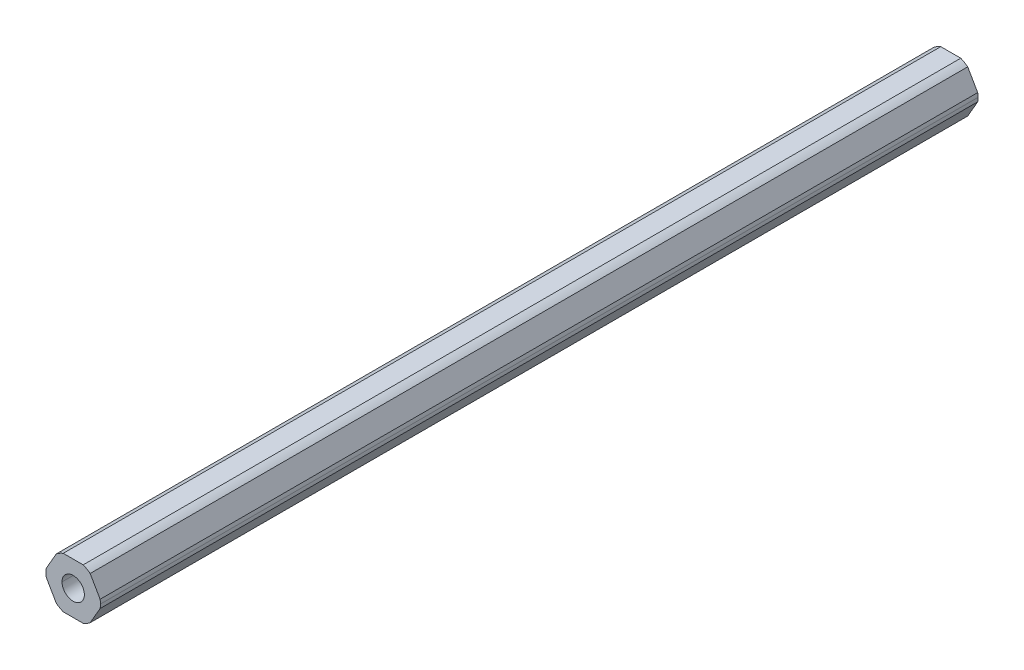
ISO-10303-21;
HEADER;
FILE_DESCRIPTION(('STEP AP214'),'2;1');
FILE_NAME('part.step','',(''),(''),'','','');
FILE_SCHEMA(('AUTOMOTIVE_DESIGN { 1 0 10303 214 1 1 1 1 }'));
ENDSEC;
DATA;
#1=APPLICATION_CONTEXT('core data for automotive mechanical design processes');
#2=APPLICATION_PROTOCOL_DEFINITION('international standard','automotive_design',2000,#1);
#3=PRODUCT_CONTEXT('',#1,'mechanical');
#4=PRODUCT('Part','Part','',(#3));
#5=PRODUCT_RELATED_PRODUCT_CATEGORY('part','',(#4));
#6=PRODUCT_DEFINITION_FORMATION('','',#4);
#7=PRODUCT_DEFINITION_CONTEXT('part definition',#1,'design');
#8=PRODUCT_DEFINITION('design','',#6,#7);
#9=PRODUCT_DEFINITION_SHAPE('','',#8);
#10=(LENGTH_UNIT() NAMED_UNIT(*) SI_UNIT(.MILLI.,.METRE.));
#11=(NAMED_UNIT(*) PLANE_ANGLE_UNIT() SI_UNIT($,.RADIAN.));
#12=(NAMED_UNIT(*) SI_UNIT($,.STERADIAN.) SOLID_ANGLE_UNIT());
#13=UNCERTAINTY_MEASURE_WITH_UNIT(LENGTH_MEASURE(1.E-05),#10,'distance_accuracy_value','');
#14=(GEOMETRIC_REPRESENTATION_CONTEXT(3) GLOBAL_UNCERTAINTY_ASSIGNED_CONTEXT((#13)) GLOBAL_UNIT_ASSIGNED_CONTEXT((#10,
#11,#12)) REPRESENTATION_CONTEXT('',''));
#15=CARTESIAN_POINT('',(0.,0.,0.));
#16=DIRECTION('',(0.,0.,1.));
#17=DIRECTION('',(1.,0.,0.));
#18=AXIS2_PLACEMENT_3D('',#15,#16,#17);
#19=CARTESIAN_POINT('',(0.,0.,-457.2));
#20=DIRECTION('',(0.,0.,1.));
#21=DIRECTION('',(1.,0.,0.));
#22=AXIS2_PLACEMENT_3D('',#19,#20,#21);
#23=CYLINDRICAL_SURFACE('',#22,2.1);
#24=CARTESIAN_POINT('',(0.,0.,-292.2));
#25=DIRECTION('',(0.,0.,1.));
#26=DIRECTION('',(1.,0.,0.));
#27=AXIS2_PLACEMENT_3D('',#24,#25,#26);
#28=CIRCLE('',#27,2.1);
#29=CARTESIAN_POINT('',(2.1,0.,-292.2));
#30=VERTEX_POINT('',#29);
#31=CARTESIAN_POINT('',(-2.1,0.,-292.2));
#32=VERTEX_POINT('',#31);
#33=EDGE_CURVE('E70',#30,#32,#28,.F.);
#34=ORIENTED_EDGE('',*,*,#33,.F.);
#35=DIRECTION('',(0.,0.,1.));
#36=VECTOR('',#35,1.);
#37=CARTESIAN_POINT('',(2.1,0.,-457.2));
#38=LINE('',#37,#36);
#39=CARTESIAN_POINT('',(2.1,0.,-457.2));
#40=VERTEX_POINT('',#39);
#41=EDGE_CURVE('E217',#40,#30,#38,.T.);
#42=ORIENTED_EDGE('',*,*,#41,.F.);
#43=CARTESIAN_POINT('',(0.,0.,-457.2));
#44=DIRECTION('',(0.,0.,1.));
#45=DIRECTION('',(1.,0.,0.));
#46=AXIS2_PLACEMENT_3D('',#43,#44,#45);
#47=CIRCLE('',#46,2.1);
#48=CARTESIAN_POINT('',(-2.1,0.,-457.2));
#49=VERTEX_POINT('',#48);
#50=EDGE_CURVE('E197',#49,#40,#47,.T.);
#51=ORIENTED_EDGE('',*,*,#50,.F.);
#52=DIRECTION('',(0.,0.,1.));
#53=VECTOR('',#52,1.);
#54=CARTESIAN_POINT('',(-2.1,0.,-457.2));
#55=LINE('',#54,#53);
#56=EDGE_CURVE('E57',#49,#32,#55,.T.);
#57=ORIENTED_EDGE('',*,*,#56,.T.);
#58=EDGE_LOOP('',(#34,#42,#51,#57));
#59=FACE_BOUND('',#58,.T.);
#60=ADVANCED_FACE('F48',(#59),#23,.F.);
#61=CARTESIAN_POINT('',(0.,0.,-457.2));
#62=DIRECTION('',(0.,0.,1.));
#63=DIRECTION('',(1.,0.,0.));
#64=AXIS2_PLACEMENT_3D('',#61,#62,#63);
#65=CYLINDRICAL_SURFACE('',#64,5.12);
#66=DIRECTION('',(0.,0.,1.));
#67=VECTOR('',#66,1.);
#68=CARTESIAN_POINT('',(5.12,0.,-457.2));
#69=LINE('',#68,#67);
#70=CARTESIAN_POINT('',(5.12,0.,-457.2));
#71=VERTEX_POINT('',#70);
#72=CARTESIAN_POINT('',(5.12,0.,-292.2));
#73=VERTEX_POINT('',#72);
#74=EDGE_CURVE('E232',#71,#73,#69,.T.);
#75=ORIENTED_EDGE('',*,*,#74,.T.);
#76=CARTESIAN_POINT('',(0.,0.,-292.2));
#77=DIRECTION('',(0.,0.,1.));
#78=DIRECTION('',(1.,0.,0.));
#79=AXIS2_PLACEMENT_3D('',#76,#77,#78);
#80=CIRCLE('',#79,5.12);
#81=CARTESIAN_POINT('',(5.06425896558911,-0.753446168913432,-292.2));
#82=VERTEX_POINT('',#81);
#83=EDGE_CURVE('E171',#82,#73,#80,.T.);
#84=ORIENTED_EDGE('',*,*,#83,.F.);
#85=DIRECTION('',(0.,0.,-1.));
#86=VECTOR('',#85,1.);
#87=CARTESIAN_POINT('',(5.06425896558911,-0.753446168913433,-457.2));
#88=LINE('',#87,#86);
#89=CARTESIAN_POINT('',(5.06425896558911,-0.753446168913433,-457.2));
#90=VERTEX_POINT('',#89);
#91=EDGE_CURVE('E236',#82,#90,#88,.T.);
#92=ORIENTED_EDGE('',*,*,#91,.T.);
#93=CARTESIAN_POINT('',(0.,0.,-457.2));
#94=DIRECTION('',(0.,0.,1.));
#95=DIRECTION('',(1.,0.,0.));
#96=AXIS2_PLACEMENT_3D('',#93,#94,#95);
#97=CIRCLE('',#96,5.12);
#98=EDGE_CURVE('E235',#90,#71,#97,.T.);
#99=ORIENTED_EDGE('',*,*,#98,.T.);
#100=EDGE_LOOP('',(#75,#84,#92,#99));
#101=FACE_BOUND('',#100,.T.);
#102=ADVANCED_FACE('F417',(#101),#65,.T.);
#103=CARTESIAN_POINT('',(2.74963065701564,-4.7625,457.2));
#104=DIRECTION('',(-0.866025403784442,0.5,0.));
#105=DIRECTION('',(0.,0.,1.));
#106=AXIS2_PLACEMENT_3D('',#103,#104,#105);
#107=PLANE('',#106);
#108=DIRECTION('',(0.499999999999988,0.866025403784446,0.));
#109=VECTOR('',#108,1.);
#110=CARTESIAN_POINT('',(3.18463300545771,-4.00905383108655,-292.2));
#111=LINE('',#110,#109);
#112=CARTESIAN_POINT('',(3.18463300545771,-4.00905383108655,-292.2));
#113=VERTEX_POINT('',#112);
#114=EDGE_CURVE('E323',#113,#82,#111,.T.);
#115=ORIENTED_EDGE('',*,*,#114,.F.);
#116=DIRECTION('',(0.,0.,1.));
#117=VECTOR('',#116,1.);
#118=CARTESIAN_POINT('',(3.1846330054577,-4.00905383108652,-457.2));
#119=LINE('',#118,#117);
#120=CARTESIAN_POINT('',(3.1846330054577,-4.00905383108652,-457.2));
#121=VERTEX_POINT('',#120);
#122=EDGE_CURVE('E192',#121,#113,#119,.T.);
#123=ORIENTED_EDGE('',*,*,#122,.F.);
#124=DIRECTION('',(0.5,0.866025403784442,0.));
#125=VECTOR('',#124,1.);
#126=CARTESIAN_POINT('',(2.74963065701564,-4.7625,-457.2));
#127=LINE('',#126,#125);
#128=EDGE_CURVE('E246',#121,#90,#127,.T.);
#129=ORIENTED_EDGE('',*,*,#128,.T.);
#130=ORIENTED_EDGE('',*,*,#91,.F.);
#131=EDGE_LOOP('',(#115,#123,#129,#130));
#132=FACE_BOUND('',#131,.T.);
#133=ADVANCED_FACE('F426',(#132),#107,.F.);
#134=CARTESIAN_POINT('',(5.49926131403117,0.,457.2));
#135=DIRECTION('',(-0.866025403784438,-0.5,0.));
#136=DIRECTION('',(-0.5,0.866025403784438,0.));
#137=AXIS2_PLACEMENT_3D('',#134,#135,#136);
#138=PLANE('',#137);
#139=DIRECTION('',(-0.500000000000001,0.866025403784438,0.));
#140=VECTOR('',#139,1.);
#141=CARTESIAN_POINT('',(5.06425896558911,0.753446168913416,-292.2));
#142=LINE('',#141,#140);
#143=CARTESIAN_POINT('',(5.06425896558911,0.753446168913416,-292.2));
#144=VERTEX_POINT('',#143);
#145=CARTESIAN_POINT('',(3.18463300545762,4.00905383108658,-292.2));
#146=VERTEX_POINT('',#145);
#147=EDGE_CURVE('E64',#144,#146,#142,.T.);
#148=ORIENTED_EDGE('',*,*,#147,.F.);
#149=DIRECTION('',(0.,0.,1.));
#150=VECTOR('',#149,1.);
#151=CARTESIAN_POINT('',(5.06425896558911,0.753446168913412,-457.2));
#152=LINE('',#151,#150);
#153=CARTESIAN_POINT('',(5.06425896558911,0.753446168913416,-457.2));
#154=VERTEX_POINT('',#153);
#155=EDGE_CURVE('E181',#154,#144,#152,.T.);
#156=ORIENTED_EDGE('',*,*,#155,.F.);
#157=DIRECTION('',(-0.5,0.866025403784438,0.));
#158=VECTOR('',#157,1.);
#159=CARTESIAN_POINT('',(5.49926131403117,0.,-457.2));
#160=LINE('',#159,#158);
#161=CARTESIAN_POINT('',(3.18463300545762,4.00905383108658,-457.2));
#162=VERTEX_POINT('',#161);
#163=EDGE_CURVE('E225',#154,#162,#160,.T.);
#164=ORIENTED_EDGE('',*,*,#163,.T.);
#165=DIRECTION('',(0.,0.,-1.));
#166=VECTOR('',#165,1.);
#167=CARTESIAN_POINT('',(3.18463300545762,4.00905383108658,-457.2));
#168=LINE('',#167,#166);
#169=EDGE_CURVE('E183',#146,#162,#168,.T.);
#170=ORIENTED_EDGE('',*,*,#169,.F.);
#171=EDGE_LOOP('',(#148,#156,#164,#170));
#172=FACE_BOUND('',#171,.T.);
#173=ADVANCED_FACE('F179',(#172),#138,.F.);
#174=CARTESIAN_POINT('',(2.74963065701557,4.7625,457.2));
#175=DIRECTION('',(0.,-1.,0.));
#176=DIRECTION('',(0.,0.,-1.));
#177=AXIS2_PLACEMENT_3D('',#174,#175,#176);
#178=PLANE('',#177);
#179=DIRECTION('',(-1.,0.,0.));
#180=VECTOR('',#179,1.);
#181=CARTESIAN_POINT('',(1.87962596013146,4.76249999999999,-292.2));
#182=LINE('',#181,#180);
#183=CARTESIAN_POINT('',(1.87962596013146,4.76249999999999,-292.2));
#184=VERTEX_POINT('',#183);
#185=CARTESIAN_POINT('',(-1.8796259601315,4.7625,-292.2));
#186=VERTEX_POINT('',#185);
#187=EDGE_CURVE('E346',#184,#186,#182,.T.);
#188=ORIENTED_EDGE('',*,*,#187,.F.);
#189=DIRECTION('',(0.,0.,1.));
#190=VECTOR('',#189,1.);
#191=CARTESIAN_POINT('',(1.87962596013147,4.7625,-457.2));
#192=LINE('',#191,#190);
#193=CARTESIAN_POINT('',(1.87962596013147,4.7625,-457.2));
#194=VERTEX_POINT('',#193);
#195=EDGE_CURVE('E208',#194,#184,#192,.T.);
#196=ORIENTED_EDGE('',*,*,#195,.F.);
#197=DIRECTION('',(-1.,0.,0.));
#198=VECTOR('',#197,1.);
#199=CARTESIAN_POINT('',(2.74963065701557,4.7625,-457.2));
#200=LINE('',#199,#198);
#201=CARTESIAN_POINT('',(-1.8796259601315,4.7625,-457.2));
#202=VERTEX_POINT('',#201);
#203=EDGE_CURVE('E263',#194,#202,#200,.T.);
#204=ORIENTED_EDGE('',*,*,#203,.T.);
#205=DIRECTION('',(0.,0.,-1.));
#206=VECTOR('',#205,1.);
#207=CARTESIAN_POINT('',(-1.8796259601315,4.7625,-457.2));
#208=LINE('',#207,#206);
#209=EDGE_CURVE('E255',#186,#202,#208,.T.);
#210=ORIENTED_EDGE('',*,*,#209,.F.);
#211=EDGE_LOOP('',(#188,#196,#204,#210));
#212=FACE_BOUND('',#211,.T.);
#213=ADVANCED_FACE('F443',(#212),#178,.F.);
#214=CARTESIAN_POINT('',(-2.7496306570156,4.7625,457.2));
#215=DIRECTION('',(0.866025403784442,-0.5,0.));
#216=DIRECTION('',(0.,0.,-1.));
#217=AXIS2_PLACEMENT_3D('',#214,#215,#216);
#218=PLANE('',#217);
#219=DIRECTION('',(-0.499999999999991,-0.866025403784444,0.));
#220=VECTOR('',#219,1.);
#221=CARTESIAN_POINT('',(-3.18463300545767,4.00905383108657,-292.2));
#222=LINE('',#221,#220);
#223=CARTESIAN_POINT('',(-3.18463300545767,4.00905383108657,-292.2));
#224=VERTEX_POINT('',#223);
#225=CARTESIAN_POINT('',(-5.06425896558912,0.753446168913382,-292.2));
#226=VERTEX_POINT('',#225);
#227=EDGE_CURVE('E340',#224,#226,#222,.T.);
#228=ORIENTED_EDGE('',*,*,#227,.F.);
#229=DIRECTION('',(0.,0.,1.));
#230=VECTOR('',#229,1.);
#231=CARTESIAN_POINT('',(-3.18463300545766,4.00905383108655,-457.2));
#232=LINE('',#231,#230);
#233=CARTESIAN_POINT('',(-3.18463300545766,4.00905383108655,-457.2));
#234=VERTEX_POINT('',#233);
#235=EDGE_CURVE('E215',#234,#224,#232,.T.);
#236=ORIENTED_EDGE('',*,*,#235,.F.);
#237=DIRECTION('',(-0.5,-0.866025403784442,0.));
#238=VECTOR('',#237,1.);
#239=CARTESIAN_POINT('',(-2.7496306570156,4.7625,-457.2));
#240=LINE('',#239,#238);
#241=CARTESIAN_POINT('',(-5.06425896558912,0.753446168913382,-457.2));
#242=VERTEX_POINT('',#241);
#243=EDGE_CURVE('E260',#234,#242,#240,.T.);
#244=ORIENTED_EDGE('',*,*,#243,.T.);
#245=DIRECTION('',(0.,0.,-1.));
#246=VECTOR('',#245,1.);
#247=CARTESIAN_POINT('',(-5.06425896558912,0.753446168913382,-457.2));
#248=LINE('',#247,#246);
#249=EDGE_CURVE('E245',#226,#242,#248,.T.);
#250=ORIENTED_EDGE('',*,*,#249,.F.);
#251=EDGE_LOOP('',(#228,#236,#244,#250));
#252=FACE_BOUND('',#251,.T.);
#253=ADVANCED_FACE('F276',(#252),#218,.F.);
#254=CARTESIAN_POINT('',(-5.49926131403117,0.,457.2));
#255=DIRECTION('',(0.866025403784435,0.500000000000007,0.));
#256=DIRECTION('',(0.,0.,-1.));
#257=AXIS2_PLACEMENT_3D('',#254,#255,#256);
#258=PLANE('',#257);
#259=DIRECTION('',(0.500000000000006,-0.866025403784435,0.));
#260=VECTOR('',#259,1.);
#261=CARTESIAN_POINT('',(-5.06425896558911,-0.753446168913444,-292.2));
#262=LINE('',#261,#260);
#263=CARTESIAN_POINT('',(-5.06425896558911,-0.753446168913444,-292.2));
#264=VERTEX_POINT('',#263);
#265=CARTESIAN_POINT('',(-3.1846330054576,-4.00905383108659,-292.2));
#266=VERTEX_POINT('',#265);
#267=EDGE_CURVE('E335',#264,#266,#262,.T.);
#268=ORIENTED_EDGE('',*,*,#267,.F.);
#269=DIRECTION('',(0.,0.,1.));
#270=VECTOR('',#269,1.);
#271=CARTESIAN_POINT('',(-5.06425896558911,-0.75344616891345,-457.2));
#272=LINE('',#271,#270);
#273=CARTESIAN_POINT('',(-5.06425896558911,-0.75344616891345,-457.2));
#274=VERTEX_POINT('',#273);
#275=EDGE_CURVE('E253',#274,#264,#272,.T.);
#276=ORIENTED_EDGE('',*,*,#275,.F.);
#277=DIRECTION('',(0.500000000000007,-0.866025403784435,0.));
#278=VECTOR('',#277,1.);
#279=CARTESIAN_POINT('',(-5.49926131403117,0.,-457.2));
#280=LINE('',#279,#278);
#281=CARTESIAN_POINT('',(-3.1846330054576,-4.0090538310866,-457.2));
#282=VERTEX_POINT('',#281);
#283=EDGE_CURVE('E264',#274,#282,#280,.T.);
#284=ORIENTED_EDGE('',*,*,#283,.T.);
#285=DIRECTION('',(0.,0.,-1.));
#286=VECTOR('',#285,1.);
#287=CARTESIAN_POINT('',(-3.1846330054576,-4.0090538310866,-457.2));
#288=LINE('',#287,#286);
#289=EDGE_CURVE('E227',#266,#282,#288,.T.);
#290=ORIENTED_EDGE('',*,*,#289,.F.);
#291=EDGE_LOOP('',(#268,#276,#284,#290));
#292=FACE_BOUND('',#291,.T.);
#293=ADVANCED_FACE('F459',(#292),#258,.F.);
#294=CARTESIAN_POINT('',(-2.74963065701554,-4.7625,457.2));
#295=DIRECTION('',(0.,1.,0.));
#296=DIRECTION('',(1.,0.,0.));
#297=AXIS2_PLACEMENT_3D('',#294,#295,#296);
#298=PLANE('',#297);
#299=DIRECTION('',(1.,0.,0.));
#300=VECTOR('',#299,1.);
#301=CARTESIAN_POINT('',(-1.87962596013144,-4.7625,-292.2));
#302=LINE('',#301,#300);
#303=CARTESIAN_POINT('',(-1.87962596013144,-4.7625,-292.2));
#304=VERTEX_POINT('',#303);
#305=CARTESIAN_POINT('',(1.87962596013153,-4.7625,-292.2));
#306=VERTEX_POINT('',#305);
#307=EDGE_CURVE('E329',#304,#306,#302,.T.);
#308=ORIENTED_EDGE('',*,*,#307,.F.);
#309=DIRECTION('',(0.,0.,1.));
#310=VECTOR('',#309,1.);
#311=CARTESIAN_POINT('',(-1.87962596013144,-4.7625,-457.2));
#312=LINE('',#311,#310);
#313=CARTESIAN_POINT('',(-1.87962596013144,-4.7625,-457.2));
#314=VERTEX_POINT('',#313);
#315=EDGE_CURVE('E241',#314,#304,#312,.T.);
#316=ORIENTED_EDGE('',*,*,#315,.F.);
#317=DIRECTION('',(1.,0.,0.));
#318=VECTOR('',#317,1.);
#319=CARTESIAN_POINT('',(-2.74963065701554,-4.7625,-457.2));
#320=LINE('',#319,#318);
#321=CARTESIAN_POINT('',(1.87962596013154,-4.7625,-457.2));
#322=VERTEX_POINT('',#321);
#323=EDGE_CURVE('E289',#314,#322,#320,.T.);
#324=ORIENTED_EDGE('',*,*,#323,.T.);
#325=DIRECTION('',(0.,0.,-1.));
#326=VECTOR('',#325,1.);
#327=CARTESIAN_POINT('',(1.87962596013154,-4.7625,-457.2));
#328=LINE('',#327,#326);
#329=EDGE_CURVE('E200',#306,#322,#328,.T.);
#330=ORIENTED_EDGE('',*,*,#329,.F.);
#331=EDGE_LOOP('',(#308,#316,#324,#330));
#332=FACE_BOUND('',#331,.T.);
#333=ADVANCED_FACE('F467',(#332),#298,.F.);
#334=CARTESIAN_POINT('',(0.,0.,-457.2));
#335=DIRECTION('',(0.,0.,1.));
#336=DIRECTION('',(1.,0.,0.));
#337=AXIS2_PLACEMENT_3D('',#334,#335,#336);
#338=CYLINDRICAL_SURFACE('',#337,5.12);
#339=ORIENTED_EDGE('',*,*,#155,.T.);
#340=EDGE_CURVE('E168',#73,#144,#80,.T.);
#341=ORIENTED_EDGE('',*,*,#340,.F.);
#342=ORIENTED_EDGE('',*,*,#74,.F.);
#343=CARTESIAN_POINT('',(0.,0.,-457.2));
#344=DIRECTION('',(0.,0.,1.));
#345=DIRECTION('',(1.,0.,0.));
#346=AXIS2_PLACEMENT_3D('',#343,#344,#345);
#347=CIRCLE('',#346,5.12);
#348=EDGE_CURVE('E190',#71,#154,#347,.T.);
#349=ORIENTED_EDGE('',*,*,#348,.T.);
#350=EDGE_LOOP('',(#339,#341,#342,#349));
#351=FACE_BOUND('',#350,.T.);
#352=ADVANCED_FACE('F188',(#351),#338,.T.);
#353=CARTESIAN_POINT('',(0.,0.,-457.2));
#354=DIRECTION('',(0.,0.,1.));
#355=DIRECTION('',(1.,0.,0.));
#356=AXIS2_PLACEMENT_3D('',#353,#354,#355);
#357=CYLINDRICAL_SURFACE('',#356,5.12);
#358=ORIENTED_EDGE('',*,*,#122,.T.);
#359=CARTESIAN_POINT('',(0.,0.,-292.2));
#360=DIRECTION('',(0.,0.,1.));
#361=DIRECTION('',(1.,0.,0.));
#362=AXIS2_PLACEMENT_3D('',#359,#360,#361);
#363=CIRCLE('',#362,5.12000000000004);
#364=EDGE_CURVE('E326',#306,#113,#363,.T.);
#365=ORIENTED_EDGE('',*,*,#364,.F.);
#366=ORIENTED_EDGE('',*,*,#329,.T.);
#367=CARTESIAN_POINT('',(0.,0.,-457.2));
#368=DIRECTION('',(0.,0.,1.));
#369=DIRECTION('',(1.,0.,0.));
#370=AXIS2_PLACEMENT_3D('',#367,#368,#369);
#371=CIRCLE('',#370,5.12);
#372=EDGE_CURVE('E230',#322,#121,#371,.T.);
#373=ORIENTED_EDGE('',*,*,#372,.T.);
#374=EDGE_LOOP('',(#358,#365,#366,#373));
#375=FACE_BOUND('',#374,.T.);
#376=ADVANCED_FACE('F483',(#375),#357,.T.);
#377=CARTESIAN_POINT('',(0.,0.,-457.2));
#378=DIRECTION('',(0.,0.,1.));
#379=DIRECTION('',(1.,0.,0.));
#380=AXIS2_PLACEMENT_3D('',#377,#378,#379);
#381=CYLINDRICAL_SURFACE('',#380,5.12);
#382=ORIENTED_EDGE('',*,*,#315,.T.);
#383=CARTESIAN_POINT('',(0.,0.,-292.2));
#384=DIRECTION('',(0.,0.,1.));
#385=DIRECTION('',(1.,0.,0.));
#386=AXIS2_PLACEMENT_3D('',#383,#384,#385);
#387=CIRCLE('',#386,5.12);
#388=EDGE_CURVE('E332',#266,#304,#387,.T.);
#389=ORIENTED_EDGE('',*,*,#388,.F.);
#390=ORIENTED_EDGE('',*,*,#289,.T.);
#391=CARTESIAN_POINT('',(0.,0.,-457.2));
#392=DIRECTION('',(0.,0.,1.));
#393=DIRECTION('',(1.,0.,0.));
#394=AXIS2_PLACEMENT_3D('',#391,#392,#393);
#395=CIRCLE('',#394,5.12);
#396=EDGE_CURVE('E231',#282,#314,#395,.T.);
#397=ORIENTED_EDGE('',*,*,#396,.T.);
#398=EDGE_LOOP('',(#382,#389,#390,#397));
#399=FACE_BOUND('',#398,.T.);
#400=ADVANCED_FACE('F491',(#399),#381,.T.);
#401=CARTESIAN_POINT('',(0.,0.,-457.2));
#402=DIRECTION('',(0.,0.,1.));
#403=DIRECTION('',(1.,0.,0.));
#404=AXIS2_PLACEMENT_3D('',#401,#402,#403);
#405=CYLINDRICAL_SURFACE('',#404,5.12);
#406=ORIENTED_EDGE('',*,*,#275,.T.);
#407=CARTESIAN_POINT('',(0.,0.,-292.2));
#408=DIRECTION('',(0.,0.,1.));
#409=DIRECTION('',(1.,0.,0.));
#410=AXIS2_PLACEMENT_3D('',#407,#408,#409);
#411=CIRCLE('',#410,5.12);
#412=EDGE_CURVE('E272',#226,#264,#411,.T.);
#413=ORIENTED_EDGE('',*,*,#412,.F.);
#414=ORIENTED_EDGE('',*,*,#249,.T.);
#415=CARTESIAN_POINT('',(0.,0.,-457.2));
#416=DIRECTION('',(0.,0.,1.));
#417=DIRECTION('',(1.,0.,0.));
#418=AXIS2_PLACEMENT_3D('',#415,#416,#417);
#419=CIRCLE('',#418,5.12);
#420=EDGE_CURVE('E250',#242,#274,#419,.T.);
#421=ORIENTED_EDGE('',*,*,#420,.T.);
#422=EDGE_LOOP('',(#406,#413,#414,#421));
#423=FACE_BOUND('',#422,.T.);
#424=ADVANCED_FACE('F270',(#423),#405,.T.);
#425=CARTESIAN_POINT('',(0.,0.,-457.2));
#426=DIRECTION('',(0.,0.,1.));
#427=DIRECTION('',(1.,0.,0.));
#428=AXIS2_PLACEMENT_3D('',#425,#426,#427);
#429=CYLINDRICAL_SURFACE('',#428,5.12);
#430=ORIENTED_EDGE('',*,*,#235,.T.);
#431=CARTESIAN_POINT('',(0.,0.,-292.2));
#432=DIRECTION('',(0.,0.,1.));
#433=DIRECTION('',(1.,0.,0.));
#434=AXIS2_PLACEMENT_3D('',#431,#432,#433);
#435=CIRCLE('',#434,5.12000000000002);
#436=EDGE_CURVE('E343',#186,#224,#435,.T.);
#437=ORIENTED_EDGE('',*,*,#436,.F.);
#438=ORIENTED_EDGE('',*,*,#209,.T.);
#439=CARTESIAN_POINT('',(0.,0.,-457.2));
#440=DIRECTION('',(0.,0.,1.));
#441=DIRECTION('',(1.,0.,0.));
#442=AXIS2_PLACEMENT_3D('',#439,#440,#441);
#443=CIRCLE('',#442,5.12);
#444=EDGE_CURVE('E240',#202,#234,#443,.T.);
#445=ORIENTED_EDGE('',*,*,#444,.T.);
#446=EDGE_LOOP('',(#430,#437,#438,#445));
#447=FACE_BOUND('',#446,.T.);
#448=ADVANCED_FACE('F507',(#447),#429,.T.);
#449=CARTESIAN_POINT('',(0.,0.,-457.2));
#450=DIRECTION('',(0.,0.,1.));
#451=DIRECTION('',(1.,0.,0.));
#452=AXIS2_PLACEMENT_3D('',#449,#450,#451);
#453=CYLINDRICAL_SURFACE('',#452,5.12);
#454=ORIENTED_EDGE('',*,*,#195,.T.);
#455=CARTESIAN_POINT('',(0.,0.,-292.2));
#456=DIRECTION('',(0.,0.,1.));
#457=DIRECTION('',(1.,0.,0.));
#458=AXIS2_PLACEMENT_3D('',#455,#456,#457);
#459=CIRCLE('',#458,5.12);
#460=EDGE_CURVE('E185',#146,#184,#459,.T.);
#461=ORIENTED_EDGE('',*,*,#460,.F.);
#462=ORIENTED_EDGE('',*,*,#169,.T.);
#463=CARTESIAN_POINT('',(0.,0.,-457.2));
#464=DIRECTION('',(0.,0.,1.));
#465=DIRECTION('',(1.,0.,0.));
#466=AXIS2_PLACEMENT_3D('',#463,#464,#465);
#467=CIRCLE('',#466,5.12);
#468=EDGE_CURVE('E205',#162,#194,#467,.T.);
#469=ORIENTED_EDGE('',*,*,#468,.T.);
#470=EDGE_LOOP('',(#454,#461,#462,#469));
#471=FACE_BOUND('',#470,.T.);
#472=ADVANCED_FACE('F515',(#471),#453,.T.);
#473=CARTESIAN_POINT('',(0.,0.,-457.2));
#474=DIRECTION('',(0.,0.,1.));
#475=DIRECTION('',(1.,0.,0.));
#476=AXIS2_PLACEMENT_3D('',#473,#474,#475);
#477=CYLINDRICAL_SURFACE('',#476,2.1);
#478=CARTESIAN_POINT('',(0.,0.,-292.2));
#479=DIRECTION('',(0.,0.,1.));
#480=DIRECTION('',(1.,0.,0.));
#481=AXIS2_PLACEMENT_3D('',#478,#479,#480);
#482=CIRCLE('',#481,2.1);
#483=EDGE_CURVE('E11',#32,#30,#482,.F.);
#484=ORIENTED_EDGE('',*,*,#483,.F.);
#485=ORIENTED_EDGE('',*,*,#56,.F.);
#486=CARTESIAN_POINT('',(0.,0.,-457.2));
#487=DIRECTION('',(0.,0.,1.));
#488=DIRECTION('',(1.,0.,0.));
#489=AXIS2_PLACEMENT_3D('',#486,#487,#488);
#490=CIRCLE('',#489,2.1);
#491=EDGE_CURVE('E203',#40,#49,#490,.T.);
#492=ORIENTED_EDGE('',*,*,#491,.F.);
#493=ORIENTED_EDGE('',*,*,#41,.T.);
#494=EDGE_LOOP('',(#484,#485,#492,#493));
#495=FACE_BOUND('',#494,.T.);
#496=ADVANCED_FACE('F392',(#495),#477,.F.);
#497=CARTESIAN_POINT('',(0.,0.,-457.2));
#498=DIRECTION('',(0.,0.,1.));
#499=DIRECTION('',(1.,0.,0.));
#500=AXIS2_PLACEMENT_3D('',#497,#498,#499);
#501=PLANE('',#500);
#502=ORIENTED_EDGE('',*,*,#468,.F.);
#503=ORIENTED_EDGE('',*,*,#163,.F.);
#504=ORIENTED_EDGE('',*,*,#348,.F.);
#505=ORIENTED_EDGE('',*,*,#98,.F.);
#506=ORIENTED_EDGE('',*,*,#128,.F.);
#507=ORIENTED_EDGE('',*,*,#372,.F.);
#508=ORIENTED_EDGE('',*,*,#323,.F.);
#509=ORIENTED_EDGE('',*,*,#396,.F.);
#510=ORIENTED_EDGE('',*,*,#283,.F.);
#511=ORIENTED_EDGE('',*,*,#420,.F.);
#512=ORIENTED_EDGE('',*,*,#243,.F.);
#513=ORIENTED_EDGE('',*,*,#444,.F.);
#514=ORIENTED_EDGE('',*,*,#203,.F.);
#515=EDGE_LOOP('',(#502,#503,#504,#505,#506,#507,#508,#509,#510,#511,#512,#513,#514));
#516=FACE_BOUND('',#515,.T.);
#517=ORIENTED_EDGE('',*,*,#491,.T.);
#518=ORIENTED_EDGE('',*,*,#50,.T.);
#519=EDGE_LOOP('',(#517,#518));
#520=FACE_BOUND('',#519,.T.);
#521=ADVANCED_FACE('F50',(#516,#520),#501,.F.);
#522=CARTESIAN_POINT('',(0.,0.,-292.2));
#523=DIRECTION('',(0.,0.,1.));
#524=DIRECTION('',(1.,0.,0.));
#525=AXIS2_PLACEMENT_3D('',#522,#523,#524);
#526=PLANE('',#525);
#527=ORIENTED_EDGE('',*,*,#83,.T.);
#528=ORIENTED_EDGE('',*,*,#340,.T.);
#529=ORIENTED_EDGE('',*,*,#147,.T.);
#530=ORIENTED_EDGE('',*,*,#460,.T.);
#531=ORIENTED_EDGE('',*,*,#187,.T.);
#532=ORIENTED_EDGE('',*,*,#436,.T.);
#533=ORIENTED_EDGE('',*,*,#227,.T.);
#534=ORIENTED_EDGE('',*,*,#412,.T.);
#535=ORIENTED_EDGE('',*,*,#267,.T.);
#536=ORIENTED_EDGE('',*,*,#388,.T.);
#537=ORIENTED_EDGE('',*,*,#307,.T.);
#538=ORIENTED_EDGE('',*,*,#364,.T.);
#539=ORIENTED_EDGE('',*,*,#114,.T.);
#540=EDGE_LOOP('',(#527,#528,#529,#530,#531,#532,#533,#534,#535,#536,#537,#538,#539));
#541=FACE_BOUND('',#540,.T.);
#542=ORIENTED_EDGE('',*,*,#33,.T.);
#543=ORIENTED_EDGE('',*,*,#483,.T.);
#544=EDGE_LOOP('',(#542,#543));
#545=FACE_BOUND('',#544,.T.);
#546=ADVANCED_FACE('F169',(#541,#545),#526,.T.);
#547=CLOSED_SHELL('',(#60,#102,#133,#173,#213,#253,#293,#333,#352,#376,#400,#424,#448,#472,#496,
#521,#546));
#548=MANIFOLD_SOLID_BREP('B2',#547);
#549=ADVANCED_BREP_SHAPE_REPRESENTATION('',(#18,#548),#14);
#550=SHAPE_DEFINITION_REPRESENTATION(#9,#549);
ENDSEC;
END-ISO-10303-21;
